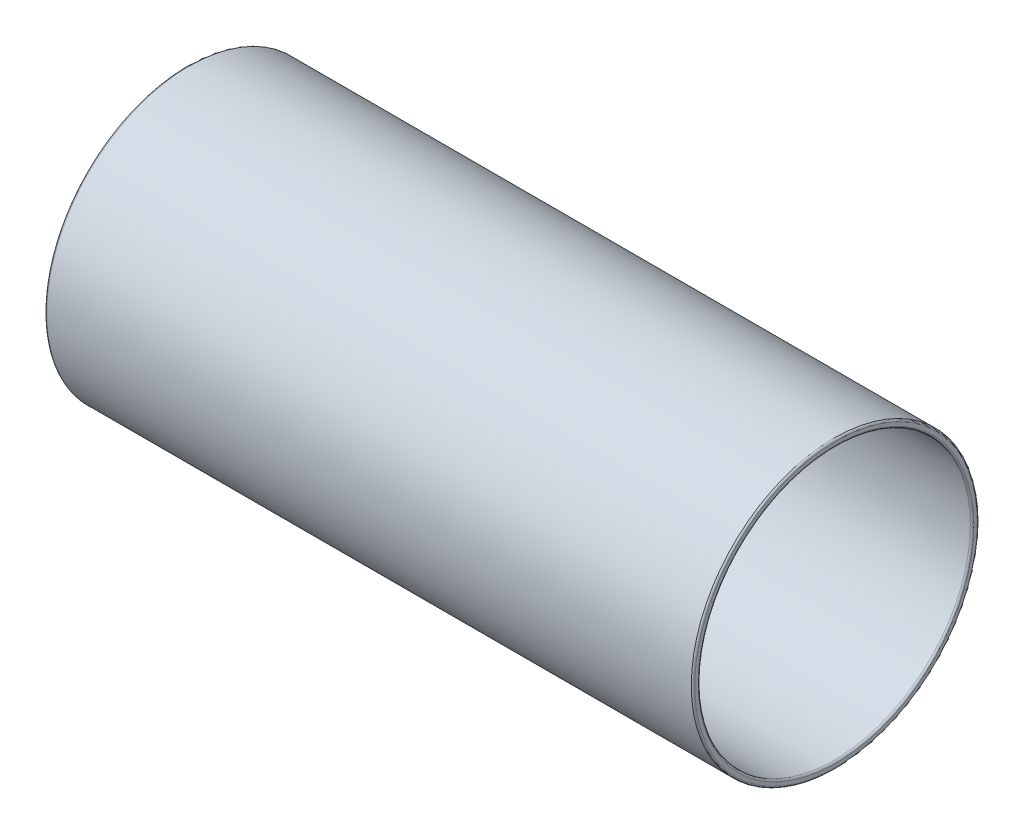
ISO-10303-21;
HEADER;
FILE_DESCRIPTION(('STEP AP214'),'2;1');
FILE_NAME('part.step','',(''),(''),'','','');
FILE_SCHEMA(('AUTOMOTIVE_DESIGN { 1 0 10303 214 1 1 1 1 }'));
ENDSEC;
DATA;
#1=APPLICATION_CONTEXT('core data for automotive mechanical design processes');
#2=APPLICATION_PROTOCOL_DEFINITION('international standard','automotive_design',2000,#1);
#3=PRODUCT_CONTEXT('',#1,'mechanical');
#4=PRODUCT('Part','Part','',(#3));
#5=PRODUCT_RELATED_PRODUCT_CATEGORY('part','',(#4));
#6=PRODUCT_DEFINITION_FORMATION('','',#4);
#7=PRODUCT_DEFINITION_CONTEXT('part definition',#1,'design');
#8=PRODUCT_DEFINITION('design','',#6,#7);
#9=PRODUCT_DEFINITION_SHAPE('','',#8);
#10=(LENGTH_UNIT() NAMED_UNIT(*) SI_UNIT(.MILLI.,.METRE.));
#11=(NAMED_UNIT(*) PLANE_ANGLE_UNIT() SI_UNIT($,.RADIAN.));
#12=(NAMED_UNIT(*) SI_UNIT($,.STERADIAN.) SOLID_ANGLE_UNIT());
#13=UNCERTAINTY_MEASURE_WITH_UNIT(LENGTH_MEASURE(1.E-05),#10,'distance_accuracy_value','');
#14=(GEOMETRIC_REPRESENTATION_CONTEXT(3) GLOBAL_UNCERTAINTY_ASSIGNED_CONTEXT((#13)) GLOBAL_UNIT_ASSIGNED_CONTEXT((#10,
#11,#12)) REPRESENTATION_CONTEXT('',''));
#15=CARTESIAN_POINT('',(0.,0.,0.));
#16=DIRECTION('',(0.,0.,1.));
#17=DIRECTION('',(1.,0.,0.));
#18=AXIS2_PLACEMENT_3D('',#15,#16,#17);
#19=CARTESIAN_POINT('',(-750.,0.,0.));
#20=DIRECTION('',(1.,0.,0.));
#21=DIRECTION('',(0.,0.,-1.));
#22=AXIS2_PLACEMENT_3D('',#19,#20,#21);
#23=CYLINDRICAL_SURFACE('',#22,165.5);
#24=CARTESIAN_POINT('',(-748.,0.,0.));
#25=DIRECTION('',(1.,0.,0.));
#26=DIRECTION('',(0.,0.,-1.));
#27=AXIS2_PLACEMENT_3D('',#24,#25,#26);
#28=CIRCLE('',#27,165.5);
#29=CARTESIAN_POINT('',(-748.,0.,-165.5));
#30=VERTEX_POINT('',#29);
#31=EDGE_CURVE('E51',#30,#30,#28,.T.);
#32=ORIENTED_EDGE('',*,*,#31,.T.);
#33=EDGE_LOOP('',(#32));
#34=FACE_BOUND('',#33,.T.);
#35=CARTESIAN_POINT('',(-2.,0.,0.));
#36=DIRECTION('',(1.,0.,0.));
#37=DIRECTION('',(0.,0.,-1.));
#38=AXIS2_PLACEMENT_3D('',#35,#36,#37);
#39=CIRCLE('',#38,165.5);
#40=CARTESIAN_POINT('',(-2.,0.,-165.5));
#41=VERTEX_POINT('',#40);
#42=EDGE_CURVE('E59',#41,#41,#39,.F.);
#43=ORIENTED_EDGE('',*,*,#42,.T.);
#44=EDGE_LOOP('',(#43));
#45=FACE_BOUND('',#44,.T.);
#46=ADVANCED_FACE('F36',(#34,#45),#23,.T.);
#47=CARTESIAN_POINT('',(-750.,0.,0.));
#48=DIRECTION('',(1.,0.,0.));
#49=DIRECTION('',(0.,0.,-1.));
#50=AXIS2_PLACEMENT_3D('',#47,#48,#49);
#51=PLANE('',#50);
#52=CARTESIAN_POINT('',(-750.,0.,0.));
#53=DIRECTION('',(1.,0.,0.));
#54=DIRECTION('',(0.,0.,-1.));
#55=AXIS2_PLACEMENT_3D('',#52,#53,#54);
#56=CIRCLE('',#55,163.5);
#57=CARTESIAN_POINT('',(-750.,0.,-163.5));
#58=VERTEX_POINT('',#57);
#59=EDGE_CURVE('E43',#58,#58,#56,.F.);
#60=ORIENTED_EDGE('',*,*,#59,.T.);
#61=EDGE_LOOP('',(#60));
#62=FACE_BOUND('',#61,.T.);
#63=CARTESIAN_POINT('',(-750.,0.,0.));
#64=DIRECTION('',(1.,0.,0.));
#65=DIRECTION('',(0.,0.,-1.));
#66=AXIS2_PLACEMENT_3D('',#63,#64,#65);
#67=CIRCLE('',#66,159.5);
#68=CARTESIAN_POINT('',(-750.,0.,-159.5));
#69=VERTEX_POINT('',#68);
#70=EDGE_CURVE('E47',#69,#69,#67,.T.);
#71=ORIENTED_EDGE('',*,*,#70,.T.);
#72=EDGE_LOOP('',(#71));
#73=FACE_BOUND('',#72,.T.);
#74=ADVANCED_FACE('F88',(#62,#73),#51,.F.);
#75=CARTESIAN_POINT('',(0.,0.,0.));
#76=DIRECTION('',(1.,0.,0.));
#77=DIRECTION('',(0.,0.,-1.));
#78=AXIS2_PLACEMENT_3D('',#75,#76,#77);
#79=PLANE('',#78);
#80=CARTESIAN_POINT('',(0.,0.,0.));
#81=DIRECTION('',(1.,0.,0.));
#82=DIRECTION('',(0.,0.,-1.));
#83=AXIS2_PLACEMENT_3D('',#80,#81,#82);
#84=CIRCLE('',#83,163.5);
#85=CARTESIAN_POINT('',(0.,0.,-163.5));
#86=VERTEX_POINT('',#85);
#87=EDGE_CURVE('E62',#86,#86,#84,.T.);
#88=ORIENTED_EDGE('',*,*,#87,.T.);
#89=EDGE_LOOP('',(#88));
#90=FACE_BOUND('',#89,.T.);
#91=CARTESIAN_POINT('',(0.,0.,0.));
#92=DIRECTION('',(1.,0.,0.));
#93=DIRECTION('',(0.,0.,-1.));
#94=AXIS2_PLACEMENT_3D('',#91,#92,#93);
#95=CIRCLE('',#94,159.5);
#96=CARTESIAN_POINT('',(0.,0.,-159.5));
#97=VERTEX_POINT('',#96);
#98=EDGE_CURVE('E65',#97,#97,#95,.F.);
#99=ORIENTED_EDGE('',*,*,#98,.T.);
#100=EDGE_LOOP('',(#99));
#101=FACE_BOUND('',#100,.T.);
#102=ADVANCED_FACE('F69',(#90,#101),#79,.T.);
#103=CARTESIAN_POINT('',(-750.,0.,0.));
#104=DIRECTION('',(1.,0.,0.));
#105=DIRECTION('',(0.,0.,-1.));
#106=AXIS2_PLACEMENT_3D('',#103,#104,#105);
#107=CYLINDRICAL_SURFACE('',#106,157.5);
#108=CARTESIAN_POINT('',(-748.,0.,0.));
#109=DIRECTION('',(1.,0.,0.));
#110=DIRECTION('',(0.,0.,-1.));
#111=AXIS2_PLACEMENT_3D('',#108,#109,#110);
#112=CIRCLE('',#111,157.5);
#113=CARTESIAN_POINT('',(-748.,0.,-157.5));
#114=VERTEX_POINT('',#113);
#115=EDGE_CURVE('E10',#114,#114,#112,.F.);
#116=ORIENTED_EDGE('',*,*,#115,.T.);
#117=EDGE_LOOP('',(#116));
#118=FACE_BOUND('',#117,.T.);
#119=CARTESIAN_POINT('',(-2.,0.,0.));
#120=DIRECTION('',(1.,0.,0.));
#121=DIRECTION('',(0.,0.,-1.));
#122=AXIS2_PLACEMENT_3D('',#119,#120,#121);
#123=CIRCLE('',#122,157.5);
#124=CARTESIAN_POINT('',(-2.,0.,-157.5));
#125=VERTEX_POINT('',#124);
#126=EDGE_CURVE('E56',#125,#125,#123,.T.);
#127=ORIENTED_EDGE('',*,*,#126,.T.);
#128=EDGE_LOOP('',(#127));
#129=FACE_BOUND('',#128,.T.);
#130=ADVANCED_FACE('F79',(#118,#129),#107,.F.);
#131=CARTESIAN_POINT('',(-2.,0.,0.));
#132=DIRECTION('',(1.,0.,0.));
#133=DIRECTION('',(0.,0.,-1.));
#134=AXIS2_PLACEMENT_3D('',#131,#132,#133);
#135=TOROIDAL_SURFACE('',#134,163.5,2.);
#136=ORIENTED_EDGE('',*,*,#42,.F.);
#137=EDGE_LOOP('',(#136));
#138=FACE_BOUND('',#137,.T.);
#139=ORIENTED_EDGE('',*,*,#87,.F.);
#140=EDGE_LOOP('',(#139));
#141=FACE_BOUND('',#140,.T.);
#142=ADVANCED_FACE('F75',(#138,#141),#135,.T.);
#143=CARTESIAN_POINT('',(-2.,0.,0.));
#144=DIRECTION('',(1.,0.,0.));
#145=DIRECTION('',(0.,0.,-1.));
#146=AXIS2_PLACEMENT_3D('',#143,#144,#145);
#147=TOROIDAL_SURFACE('',#146,159.5,2.);
#148=ORIENTED_EDGE('',*,*,#98,.F.);
#149=EDGE_LOOP('',(#148));
#150=FACE_BOUND('',#149,.T.);
#151=ORIENTED_EDGE('',*,*,#126,.F.);
#152=EDGE_LOOP('',(#151));
#153=FACE_BOUND('',#152,.T.);
#154=ADVANCED_FACE('F71',(#150,#153),#147,.T.);
#155=CARTESIAN_POINT('',(-748.,0.,0.));
#156=DIRECTION('',(1.,0.,0.));
#157=DIRECTION('',(0.,0.,-1.));
#158=AXIS2_PLACEMENT_3D('',#155,#156,#157);
#159=TOROIDAL_SURFACE('',#158,163.5,2.);
#160=ORIENTED_EDGE('',*,*,#59,.F.);
#161=EDGE_LOOP('',(#160));
#162=FACE_BOUND('',#161,.T.);
#163=ORIENTED_EDGE('',*,*,#31,.F.);
#164=EDGE_LOOP('',(#163));
#165=FACE_BOUND('',#164,.T.);
#166=ADVANCED_FACE('F74',(#162,#165),#159,.T.);
#167=CARTESIAN_POINT('',(-748.,0.,0.));
#168=DIRECTION('',(1.,0.,0.));
#169=DIRECTION('',(0.,0.,-1.));
#170=AXIS2_PLACEMENT_3D('',#167,#168,#169);
#171=TOROIDAL_SURFACE('',#170,159.5,2.);
#172=ORIENTED_EDGE('',*,*,#115,.F.);
#173=EDGE_LOOP('',(#172));
#174=FACE_BOUND('',#173,.T.);
#175=ORIENTED_EDGE('',*,*,#70,.F.);
#176=EDGE_LOOP('',(#175));
#177=FACE_BOUND('',#176,.T.);
#178=ADVANCED_FACE('F38',(#174,#177),#171,.T.);
#179=CLOSED_SHELL('',(#46,#74,#102,#130,#142,#154,#166,#178));
#180=MANIFOLD_SOLID_BREP('B2',#179);
#181=ADVANCED_BREP_SHAPE_REPRESENTATION('',(#18,#180),#14);
#182=SHAPE_DEFINITION_REPRESENTATION(#9,#181);
ENDSEC;
END-ISO-10303-21;
